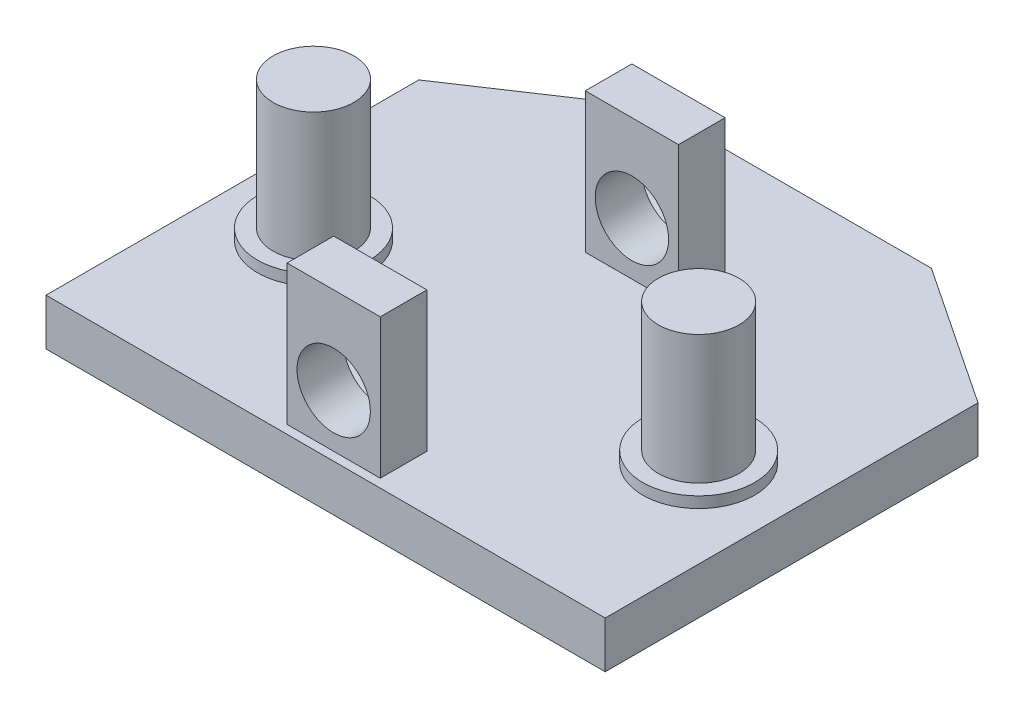
ISO-10303-21;
HEADER;
FILE_DESCRIPTION(('STEP AP214'),'2;1');
FILE_NAME('part.step','',(''),(''),'','','');
FILE_SCHEMA(('AUTOMOTIVE_DESIGN { 1 0 10303 214 1 1 1 1 }'));
ENDSEC;
DATA;
#1=APPLICATION_CONTEXT('core data for automotive mechanical design processes');
#2=APPLICATION_PROTOCOL_DEFINITION('international standard','automotive_design',2000,#1);
#3=PRODUCT_CONTEXT('',#1,'mechanical');
#4=PRODUCT('Part','Part','',(#3));
#5=PRODUCT_RELATED_PRODUCT_CATEGORY('part','',(#4));
#6=PRODUCT_DEFINITION_FORMATION('','',#4);
#7=PRODUCT_DEFINITION_CONTEXT('part definition',#1,'design');
#8=PRODUCT_DEFINITION('design','',#6,#7);
#9=PRODUCT_DEFINITION_SHAPE('','',#8);
#10=(LENGTH_UNIT() NAMED_UNIT(*) SI_UNIT(.MILLI.,.METRE.));
#11=(NAMED_UNIT(*) PLANE_ANGLE_UNIT() SI_UNIT($,.RADIAN.));
#12=(NAMED_UNIT(*) SI_UNIT($,.STERADIAN.) SOLID_ANGLE_UNIT());
#13=UNCERTAINTY_MEASURE_WITH_UNIT(LENGTH_MEASURE(1.E-05),#10,'distance_accuracy_value','');
#14=(GEOMETRIC_REPRESENTATION_CONTEXT(3) GLOBAL_UNCERTAINTY_ASSIGNED_CONTEXT((#13)) GLOBAL_UNIT_ASSIGNED_CONTEXT((#10,
#11,#12)) REPRESENTATION_CONTEXT('',''));
#15=CARTESIAN_POINT('',(0.,0.,0.));
#16=DIRECTION('',(0.,0.,1.));
#17=DIRECTION('',(1.,0.,0.));
#18=AXIS2_PLACEMENT_3D('',#15,#16,#17);
#19=CARTESIAN_POINT('',(0.,6.35,0.));
#20=DIRECTION('',(0.,-1.,0.));
#21=DIRECTION('',(0.,0.,-1.));
#22=AXIS2_PLACEMENT_3D('',#19,#20,#21);
#23=PLANE('',#22);
#24=CARTESIAN_POINT('',(26.1732375243136,6.35,-24.6662117629538));
#25=DIRECTION('',(0.,-1.,0.));
#26=DIRECTION('',(0.,0.,-1.));
#27=AXIS2_PLACEMENT_3D('',#24,#25,#26);
#28=CIRCLE('',#27,7.62);
#29=CARTESIAN_POINT('',(26.1732375243136,6.35,-32.2862117629538));
#30=VERTEX_POINT('',#29);
#31=EDGE_CURVE('E11',#30,#30,#28,.F.);
#32=ORIENTED_EDGE('',*,*,#31,.F.);
#33=EDGE_LOOP('',(#32));
#34=FACE_BOUND('',#33,.T.);
#35=CARTESIAN_POINT('',(-26.3178350396864,6.35,-24.6662117629538));
#36=DIRECTION('',(0.,-1.,0.));
#37=DIRECTION('',(0.,0.,-1.));
#38=AXIS2_PLACEMENT_3D('',#35,#36,#37);
#39=CIRCLE('',#38,7.62);
#40=CARTESIAN_POINT('',(-26.3178350396864,6.35,-32.2862117629538));
#41=VERTEX_POINT('',#40);
#42=EDGE_CURVE('E234',#41,#41,#39,.F.);
#43=ORIENTED_EDGE('',*,*,#42,.F.);
#44=EDGE_LOOP('',(#43));
#45=FACE_BOUND('',#44,.T.);
#46=DIRECTION('',(0.,0.,-1.));
#47=VECTOR('',#46,1.);
#48=CARTESIAN_POINT('',(6.27770124231356,6.35,-1.1712117629538));
#49=LINE('',#48,#47);
#50=CARTESIAN_POINT('',(6.27770124231356,6.35,-1.1712117629538));
#51=VERTEX_POINT('',#50);
#52=CARTESIAN_POINT('',(6.27770124231356,6.35,-7.5212117629538));
#53=VERTEX_POINT('',#52);
#54=EDGE_CURVE('E165',#51,#53,#49,.T.);
#55=ORIENTED_EDGE('',*,*,#54,.F.);
#56=DIRECTION('',(1.,0.,0.));
#57=VECTOR('',#56,1.);
#58=CARTESIAN_POINT('',(-6.42229875768644,6.35,-1.1712117629538));
#59=LINE('',#58,#57);
#60=CARTESIAN_POINT('',(-6.42229875768644,6.35,-1.1712117629538));
#61=VERTEX_POINT('',#60);
#62=EDGE_CURVE('E170',#61,#51,#59,.T.);
#63=ORIENTED_EDGE('',*,*,#62,.F.);
#64=DIRECTION('',(0.,0.,1.));
#65=VECTOR('',#64,1.);
#66=CARTESIAN_POINT('',(-6.42229875768644,6.35,-1.1712117629538));
#67=LINE('',#66,#65);
#68=CARTESIAN_POINT('',(-6.42229875768644,6.35,-7.5212117629538));
#69=VERTEX_POINT('',#68);
#70=EDGE_CURVE('E182',#69,#61,#67,.T.);
#71=ORIENTED_EDGE('',*,*,#70,.F.);
#72=DIRECTION('',(-1.,0.,0.));
#73=VECTOR('',#72,1.);
#74=CARTESIAN_POINT('',(-6.42229875768644,6.35,-7.5212117629538));
#75=LINE('',#74,#73);
#76=EDGE_CURVE('E179',#53,#69,#75,.T.);
#77=ORIENTED_EDGE('',*,*,#76,.F.);
#78=EDGE_LOOP('',(#55,#63,#71,#77));
#79=FACE_BOUND('',#78,.T.);
#80=DIRECTION('',(0.,0.,-1.));
#81=VECTOR('',#80,1.);
#82=CARTESIAN_POINT('',(-38.1,6.35,0.));
#83=LINE('',#82,#81);
#84=CARTESIAN_POINT('',(-38.1,6.35,0.));
#85=VERTEX_POINT('',#84);
#86=CARTESIAN_POINT('',(-38.1,6.35,-50.8));
#87=VERTEX_POINT('',#86);
#88=EDGE_CURVE('E199',#85,#87,#83,.T.);
#89=ORIENTED_EDGE('',*,*,#88,.F.);
#90=DIRECTION('',(1.,0.,0.));
#91=VECTOR('',#90,1.);
#92=CARTESIAN_POINT('',(-38.1,6.35,0.));
#93=LINE('',#92,#91);
#94=CARTESIAN_POINT('',(38.1,6.35,0.));
#95=VERTEX_POINT('',#94);
#96=EDGE_CURVE('E214',#85,#95,#93,.T.);
#97=ORIENTED_EDGE('',*,*,#96,.T.);
#98=DIRECTION('',(0.,0.,-1.));
#99=VECTOR('',#98,1.);
#100=CARTESIAN_POINT('',(38.1,6.35,0.));
#101=LINE('',#100,#99);
#102=CARTESIAN_POINT('',(38.1,6.35,-50.8));
#103=VERTEX_POINT('',#102);
#104=EDGE_CURVE('E212',#95,#103,#101,.T.);
#105=ORIENTED_EDGE('',*,*,#104,.T.);
#106=DIRECTION('',(0.832050294337843,0.,0.554700196225229));
#107=VECTOR('',#106,1.);
#108=CARTESIAN_POINT('',(19.05,6.35,-63.5));
#109=LINE('',#108,#107);
#110=CARTESIAN_POINT('',(19.05,6.35,-63.5));
#111=VERTEX_POINT('',#110);
#112=EDGE_CURVE('E209',#111,#103,#109,.T.);
#113=ORIENTED_EDGE('',*,*,#112,.F.);
#114=DIRECTION('',(1.,0.,0.));
#115=VECTOR('',#114,1.);
#116=CARTESIAN_POINT('',(-19.05,6.35,-63.5));
#117=LINE('',#116,#115);
#118=CARTESIAN_POINT('',(-19.05,6.35,-63.5));
#119=VERTEX_POINT('',#118);
#120=EDGE_CURVE('E206',#119,#111,#117,.T.);
#121=ORIENTED_EDGE('',*,*,#120,.F.);
#122=DIRECTION('',(0.832050294337844,0.,-0.554700196225229));
#123=VECTOR('',#122,1.);
#124=CARTESIAN_POINT('',(-38.1,6.35,-50.8));
#125=LINE('',#124,#123);
#126=EDGE_CURVE('E202',#87,#119,#125,.T.);
#127=ORIENTED_EDGE('',*,*,#126,.F.);
#128=EDGE_LOOP('',(#89,#97,#105,#113,#121,#127));
#129=FACE_BOUND('',#128,.T.);
#130=DIRECTION('',(0.,0.,-1.));
#131=VECTOR('',#130,1.);
#132=CARTESIAN_POINT('',(6.27770124231356,6.35,-41.8112117629538));
#133=LINE('',#132,#131);
#134=CARTESIAN_POINT('',(6.27770124231356,6.35,-41.8112117629538));
#135=VERTEX_POINT('',#134);
#136=CARTESIAN_POINT('',(6.27770124231356,6.35,-48.1612117629538));
#137=VERTEX_POINT('',#136);
#138=EDGE_CURVE('E153',#135,#137,#133,.T.);
#139=ORIENTED_EDGE('',*,*,#138,.F.);
#140=DIRECTION('',(1.,0.,0.));
#141=VECTOR('',#140,1.);
#142=CARTESIAN_POINT('',(-6.42229875768644,6.35,-41.8112117629538));
#143=LINE('',#142,#141);
#144=CARTESIAN_POINT('',(-6.42229875768644,6.35,-41.8112117629538));
#145=VERTEX_POINT('',#144);
#146=EDGE_CURVE('E150',#145,#135,#143,.T.);
#147=ORIENTED_EDGE('',*,*,#146,.F.);
#148=DIRECTION('',(0.,0.,1.));
#149=VECTOR('',#148,1.);
#150=CARTESIAN_POINT('',(-6.42229875768644,6.35,-41.8112117629538));
#151=LINE('',#150,#149);
#152=CARTESIAN_POINT('',(-6.42229875768644,6.35,-48.1612117629538));
#153=VERTEX_POINT('',#152);
#154=EDGE_CURVE('E52',#153,#145,#151,.T.);
#155=ORIENTED_EDGE('',*,*,#154,.F.);
#156=DIRECTION('',(-1.,0.,0.));
#157=VECTOR('',#156,1.);
#158=CARTESIAN_POINT('',(-6.42229875768644,6.35,-48.1612117629538));
#159=LINE('',#158,#157);
#160=EDGE_CURVE('E47',#137,#153,#159,.T.);
#161=ORIENTED_EDGE('',*,*,#160,.F.);
#162=EDGE_LOOP('',(#139,#147,#155,#161));
#163=FACE_BOUND('',#162,.T.);
#164=ADVANCED_FACE('F32',(#34,#45,#79,#129,#163),#23,.F.);
#165=CARTESIAN_POINT('',(-38.1,6.35,0.));
#166=DIRECTION('',(-1.,0.,0.));
#167=DIRECTION('',(0.,0.,1.));
#168=AXIS2_PLACEMENT_3D('',#165,#166,#167);
#169=PLANE('',#168);
#170=DIRECTION('',(0.,0.,-1.));
#171=VECTOR('',#170,1.);
#172=CARTESIAN_POINT('',(-38.1,0.,0.));
#173=LINE('',#172,#171);
#174=CARTESIAN_POINT('',(-38.1,0.,0.));
#175=VERTEX_POINT('',#174);
#176=CARTESIAN_POINT('',(-38.1,0.,-50.8));
#177=VERTEX_POINT('',#176);
#178=EDGE_CURVE('E198',#175,#177,#173,.T.);
#179=ORIENTED_EDGE('',*,*,#178,.F.);
#180=DIRECTION('',(0.,-1.,0.));
#181=VECTOR('',#180,1.);
#182=CARTESIAN_POINT('',(-38.1,6.35,0.));
#183=LINE('',#182,#181);
#184=EDGE_CURVE('E232',#85,#175,#183,.T.);
#185=ORIENTED_EDGE('',*,*,#184,.F.);
#186=ORIENTED_EDGE('',*,*,#88,.T.);
#187=DIRECTION('',(0.,-1.,0.));
#188=VECTOR('',#187,1.);
#189=CARTESIAN_POINT('',(-38.1,6.35,-50.8));
#190=LINE('',#189,#188);
#191=EDGE_CURVE('E216',#87,#177,#190,.T.);
#192=ORIENTED_EDGE('',*,*,#191,.T.);
#193=EDGE_LOOP('',(#179,#185,#186,#192));
#194=FACE_BOUND('',#193,.T.);
#195=ADVANCED_FACE('F34',(#194),#169,.T.);
#196=CARTESIAN_POINT('',(-38.1,6.35,0.));
#197=DIRECTION('',(0.,0.,-1.));
#198=DIRECTION('',(-1.,0.,0.));
#199=AXIS2_PLACEMENT_3D('',#196,#197,#198);
#200=PLANE('',#199);
#201=DIRECTION('',(1.,0.,0.));
#202=VECTOR('',#201,1.);
#203=CARTESIAN_POINT('',(-38.1,0.,0.));
#204=LINE('',#203,#202);
#205=CARTESIAN_POINT('',(38.1,0.,0.));
#206=VERTEX_POINT('',#205);
#207=EDGE_CURVE('E203',#175,#206,#204,.T.);
#208=ORIENTED_EDGE('',*,*,#207,.T.);
#209=DIRECTION('',(0.,-1.,0.));
#210=VECTOR('',#209,1.);
#211=CARTESIAN_POINT('',(38.1,6.35,0.));
#212=LINE('',#211,#210);
#213=EDGE_CURVE('E235',#95,#206,#212,.T.);
#214=ORIENTED_EDGE('',*,*,#213,.F.);
#215=ORIENTED_EDGE('',*,*,#96,.F.);
#216=ORIENTED_EDGE('',*,*,#184,.T.);
#217=EDGE_LOOP('',(#208,#214,#215,#216));
#218=FACE_BOUND('',#217,.T.);
#219=ADVANCED_FACE('F278',(#218),#200,.F.);
#220=CARTESIAN_POINT('',(38.1,6.35,0.));
#221=DIRECTION('',(-1.,0.,0.));
#222=DIRECTION('',(0.,0.,1.));
#223=AXIS2_PLACEMENT_3D('',#220,#221,#222);
#224=PLANE('',#223);
#225=DIRECTION('',(0.,0.,-1.));
#226=VECTOR('',#225,1.);
#227=CARTESIAN_POINT('',(38.1,0.,0.));
#228=LINE('',#227,#226);
#229=CARTESIAN_POINT('',(38.1,0.,-50.8));
#230=VERTEX_POINT('',#229);
#231=EDGE_CURVE('E228',#206,#230,#228,.T.);
#232=ORIENTED_EDGE('',*,*,#231,.T.);
#233=DIRECTION('',(0.,-1.,0.));
#234=VECTOR('',#233,1.);
#235=CARTESIAN_POINT('',(38.1,6.35,-50.8));
#236=LINE('',#235,#234);
#237=EDGE_CURVE('E238',#103,#230,#236,.T.);
#238=ORIENTED_EDGE('',*,*,#237,.F.);
#239=ORIENTED_EDGE('',*,*,#104,.F.);
#240=ORIENTED_EDGE('',*,*,#213,.T.);
#241=EDGE_LOOP('',(#232,#238,#239,#240));
#242=FACE_BOUND('',#241,.T.);
#243=ADVANCED_FACE('F293',(#242),#224,.F.);
#244=CARTESIAN_POINT('',(19.05,6.35,-63.5));
#245=DIRECTION('',(0.554700196225229,0.,-0.832050294337843));
#246=DIRECTION('',(-0.832050294337843,0.,-0.554700196225229));
#247=AXIS2_PLACEMENT_3D('',#244,#245,#246);
#248=PLANE('',#247);
#249=DIRECTION('',(0.832050294337843,0.,0.554700196225229));
#250=VECTOR('',#249,1.);
#251=CARTESIAN_POINT('',(19.05,0.,-63.5));
#252=LINE('',#251,#250);
#253=CARTESIAN_POINT('',(19.05,0.,-63.5));
#254=VERTEX_POINT('',#253);
#255=EDGE_CURVE('E225',#254,#230,#252,.T.);
#256=ORIENTED_EDGE('',*,*,#255,.F.);
#257=DIRECTION('',(0.,-1.,0.));
#258=VECTOR('',#257,1.);
#259=CARTESIAN_POINT('',(19.05,6.35,-63.5));
#260=LINE('',#259,#258);
#261=EDGE_CURVE('E240',#111,#254,#260,.T.);
#262=ORIENTED_EDGE('',*,*,#261,.F.);
#263=ORIENTED_EDGE('',*,*,#112,.T.);
#264=ORIENTED_EDGE('',*,*,#237,.T.);
#265=EDGE_LOOP('',(#256,#262,#263,#264));
#266=FACE_BOUND('',#265,.T.);
#267=ADVANCED_FACE('F297',(#266),#248,.T.);
#268=CARTESIAN_POINT('',(-19.05,6.35,-63.5));
#269=DIRECTION('',(0.,0.,-1.));
#270=DIRECTION('',(-1.,0.,0.));
#271=AXIS2_PLACEMENT_3D('',#268,#269,#270);
#272=PLANE('',#271);
#273=DIRECTION('',(1.,0.,0.));
#274=VECTOR('',#273,1.);
#275=CARTESIAN_POINT('',(-19.05,0.,-63.5));
#276=LINE('',#275,#274);
#277=CARTESIAN_POINT('',(-19.05,0.,-63.5));
#278=VERTEX_POINT('',#277);
#279=EDGE_CURVE('E222',#278,#254,#276,.T.);
#280=ORIENTED_EDGE('',*,*,#279,.F.);
#281=DIRECTION('',(0.,-1.,0.));
#282=VECTOR('',#281,1.);
#283=CARTESIAN_POINT('',(-19.05,6.35,-63.5));
#284=LINE('',#283,#282);
#285=EDGE_CURVE('E242',#119,#278,#284,.T.);
#286=ORIENTED_EDGE('',*,*,#285,.F.);
#287=ORIENTED_EDGE('',*,*,#120,.T.);
#288=ORIENTED_EDGE('',*,*,#261,.T.);
#289=EDGE_LOOP('',(#280,#286,#287,#288));
#290=FACE_BOUND('',#289,.T.);
#291=ADVANCED_FACE('F301',(#290),#272,.T.);
#292=CARTESIAN_POINT('',(-38.1,6.35,-50.8));
#293=DIRECTION('',(-0.554700196225229,0.,-0.832050294337844));
#294=DIRECTION('',(-0.832050294337844,0.,0.554700196225229));
#295=AXIS2_PLACEMENT_3D('',#292,#293,#294);
#296=PLANE('',#295);
#297=DIRECTION('',(0.832050294337844,0.,-0.554700196225229));
#298=VECTOR('',#297,1.);
#299=CARTESIAN_POINT('',(-38.1,0.,-50.8));
#300=LINE('',#299,#298);
#301=EDGE_CURVE('E219',#177,#278,#300,.T.);
#302=ORIENTED_EDGE('',*,*,#301,.F.);
#303=ORIENTED_EDGE('',*,*,#191,.F.);
#304=ORIENTED_EDGE('',*,*,#126,.T.);
#305=ORIENTED_EDGE('',*,*,#285,.T.);
#306=EDGE_LOOP('',(#302,#303,#304,#305));
#307=FACE_BOUND('',#306,.T.);
#308=ADVANCED_FACE('F289',(#307),#296,.T.);
#309=CARTESIAN_POINT('',(0.,0.,0.));
#310=DIRECTION('',(0.,-1.,0.));
#311=DIRECTION('',(0.,0.,-1.));
#312=AXIS2_PLACEMENT_3D('',#309,#310,#311);
#313=PLANE('',#312);
#314=ORIENTED_EDGE('',*,*,#178,.T.);
#315=ORIENTED_EDGE('',*,*,#301,.T.);
#316=ORIENTED_EDGE('',*,*,#279,.T.);
#317=ORIENTED_EDGE('',*,*,#255,.T.);
#318=ORIENTED_EDGE('',*,*,#231,.F.);
#319=ORIENTED_EDGE('',*,*,#207,.F.);
#320=EDGE_LOOP('',(#314,#315,#316,#317,#318,#319));
#321=FACE_BOUND('',#320,.T.);
#322=ADVANCED_FACE('F286',(#321),#313,.T.);
#323=CARTESIAN_POINT('',(6.27770124231356,25.4,-1.1712117629538));
#324=DIRECTION('',(-1.,0.,0.));
#325=DIRECTION('',(0.,0.,1.));
#326=AXIS2_PLACEMENT_3D('',#323,#324,#325);
#327=PLANE('',#326);
#328=ORIENTED_EDGE('',*,*,#54,.T.);
#329=DIRECTION('',(0.,-1.,0.));
#330=VECTOR('',#329,1.);
#331=CARTESIAN_POINT('',(6.27770124231356,25.4,-7.5212117629538));
#332=LINE('',#331,#330);
#333=CARTESIAN_POINT('',(6.27770124231356,25.4,-7.5212117629538));
#334=VERTEX_POINT('',#333);
#335=EDGE_CURVE('E195',#334,#53,#332,.T.);
#336=ORIENTED_EDGE('',*,*,#335,.F.);
#337=DIRECTION('',(0.,0.,-1.));
#338=VECTOR('',#337,1.);
#339=CARTESIAN_POINT('',(6.27770124231356,25.4,-1.1712117629538));
#340=LINE('',#339,#338);
#341=CARTESIAN_POINT('',(6.27770124231356,25.4,-1.1712117629538));
#342=VERTEX_POINT('',#341);
#343=EDGE_CURVE('E166',#342,#334,#340,.T.);
#344=ORIENTED_EDGE('',*,*,#343,.F.);
#345=DIRECTION('',(0.,-1.,0.));
#346=VECTOR('',#345,1.);
#347=CARTESIAN_POINT('',(6.27770124231356,25.4,-1.1712117629538));
#348=LINE('',#347,#346);
#349=EDGE_CURVE('E176',#342,#51,#348,.T.);
#350=ORIENTED_EDGE('',*,*,#349,.T.);
#351=EDGE_LOOP('',(#328,#336,#344,#350));
#352=FACE_BOUND('',#351,.T.);
#353=ADVANCED_FACE('F284',(#352),#327,.F.);
#354=CARTESIAN_POINT('',(-6.42229875768644,25.4,-7.5212117629538));
#355=DIRECTION('',(0.,0.,1.));
#356=DIRECTION('',(1.,0.,0.));
#357=AXIS2_PLACEMENT_3D('',#354,#355,#356);
#358=PLANE('',#357);
#359=CARTESIAN_POINT('',(-0.0722987576864415,13.5246697625888,-7.5212117629538));
#360=DIRECTION('',(0.,0.,1.));
#361=DIRECTION('',(1.,0.,0.));
#362=AXIS2_PLACEMENT_3D('',#359,#360,#361);
#363=CIRCLE('',#362,5.);
#364=CARTESIAN_POINT('',(4.92770124231356,13.5246697625888,-7.5212117629538));
#365=VERTEX_POINT('',#364);
#366=EDGE_CURVE('E157',#365,#365,#363,.T.);
#367=ORIENTED_EDGE('',*,*,#366,.T.);
#368=EDGE_LOOP('',(#367));
#369=FACE_BOUND('',#368,.T.);
#370=ORIENTED_EDGE('',*,*,#76,.T.);
#371=DIRECTION('',(0.,-1.,0.));
#372=VECTOR('',#371,1.);
#373=CARTESIAN_POINT('',(-6.42229875768644,25.4,-7.5212117629538));
#374=LINE('',#373,#372);
#375=CARTESIAN_POINT('',(-6.42229875768644,25.4,-7.5212117629538));
#376=VERTEX_POINT('',#375);
#377=EDGE_CURVE('E192',#376,#69,#374,.T.);
#378=ORIENTED_EDGE('',*,*,#377,.F.);
#379=DIRECTION('',(-1.,0.,0.));
#380=VECTOR('',#379,1.);
#381=CARTESIAN_POINT('',(-6.42229875768644,25.4,-7.5212117629538));
#382=LINE('',#381,#380);
#383=EDGE_CURVE('E169',#334,#376,#382,.T.);
#384=ORIENTED_EDGE('',*,*,#383,.F.);
#385=ORIENTED_EDGE('',*,*,#335,.T.);
#386=EDGE_LOOP('',(#370,#378,#384,#385));
#387=FACE_BOUND('',#386,.T.);
#388=ADVANCED_FACE('F401',(#369,#387),#358,.F.);
#389=CARTESIAN_POINT('',(-6.42229875768644,25.4,-1.1712117629538));
#390=DIRECTION('',(1.,0.,0.));
#391=DIRECTION('',(0.,0.,-1.));
#392=AXIS2_PLACEMENT_3D('',#389,#390,#391);
#393=PLANE('',#392);
#394=ORIENTED_EDGE('',*,*,#70,.T.);
#395=DIRECTION('',(0.,-1.,0.));
#396=VECTOR('',#395,1.);
#397=CARTESIAN_POINT('',(-6.42229875768644,25.4,-1.1712117629538));
#398=LINE('',#397,#396);
#399=CARTESIAN_POINT('',(-6.42229875768644,25.4,-1.1712117629538));
#400=VERTEX_POINT('',#399);
#401=EDGE_CURVE('E189',#400,#61,#398,.T.);
#402=ORIENTED_EDGE('',*,*,#401,.F.);
#403=DIRECTION('',(0.,0.,1.));
#404=VECTOR('',#403,1.);
#405=CARTESIAN_POINT('',(-6.42229875768644,25.4,-1.1712117629538));
#406=LINE('',#405,#404);
#407=EDGE_CURVE('E172',#376,#400,#406,.T.);
#408=ORIENTED_EDGE('',*,*,#407,.F.);
#409=ORIENTED_EDGE('',*,*,#377,.T.);
#410=EDGE_LOOP('',(#394,#402,#408,#409));
#411=FACE_BOUND('',#410,.T.);
#412=ADVANCED_FACE('F399',(#411),#393,.F.);
#413=CARTESIAN_POINT('',(-6.42229875768644,25.4,-1.1712117629538));
#414=DIRECTION('',(0.,0.,-1.));
#415=DIRECTION('',(-1.,0.,0.));
#416=AXIS2_PLACEMENT_3D('',#413,#414,#415);
#417=PLANE('',#416);
#418=CARTESIAN_POINT('',(-0.0722987576864415,13.5246697625888,-1.1712117629538));
#419=DIRECTION('',(0.,0.,1.));
#420=DIRECTION('',(1.,0.,0.));
#421=AXIS2_PLACEMENT_3D('',#418,#419,#420);
#422=CIRCLE('',#421,5.);
#423=CARTESIAN_POINT('',(4.92770124231356,13.5246697625888,-1.1712117629538));
#424=VERTEX_POINT('',#423);
#425=EDGE_CURVE('E154',#424,#424,#422,.T.);
#426=ORIENTED_EDGE('',*,*,#425,.F.);
#427=EDGE_LOOP('',(#426));
#428=FACE_BOUND('',#427,.T.);
#429=ORIENTED_EDGE('',*,*,#62,.T.);
#430=ORIENTED_EDGE('',*,*,#349,.F.);
#431=DIRECTION('',(1.,0.,0.));
#432=VECTOR('',#431,1.);
#433=CARTESIAN_POINT('',(-6.42229875768644,25.4,-1.1712117629538));
#434=LINE('',#433,#432);
#435=EDGE_CURVE('E174',#400,#342,#434,.T.);
#436=ORIENTED_EDGE('',*,*,#435,.F.);
#437=ORIENTED_EDGE('',*,*,#401,.T.);
#438=EDGE_LOOP('',(#429,#430,#436,#437));
#439=FACE_BOUND('',#438,.T.);
#440=ADVANCED_FACE('F390',(#428,#439),#417,.F.);
#441=CARTESIAN_POINT('',(0.,25.4,0.));
#442=DIRECTION('',(0.,-1.,0.));
#443=DIRECTION('',(0.,0.,-1.));
#444=AXIS2_PLACEMENT_3D('',#441,#442,#443);
#445=PLANE('',#444);
#446=ORIENTED_EDGE('',*,*,#343,.T.);
#447=ORIENTED_EDGE('',*,*,#383,.T.);
#448=ORIENTED_EDGE('',*,*,#407,.T.);
#449=ORIENTED_EDGE('',*,*,#435,.T.);
#450=EDGE_LOOP('',(#446,#447,#448,#449));
#451=FACE_BOUND('',#450,.T.);
#452=ADVANCED_FACE('F395',(#451),#445,.F.);
#453=CARTESIAN_POINT('',(-0.0722987576864415,13.5246697625888,-13.8712117629538));
#454=DIRECTION('',(0.,0.,1.));
#455=DIRECTION('',(1.,0.,0.));
#456=AXIS2_PLACEMENT_3D('',#453,#454,#455);
#457=CYLINDRICAL_SURFACE('',#456,5.);
#458=ORIENTED_EDGE('',*,*,#425,.T.);
#459=EDGE_LOOP('',(#458));
#460=FACE_BOUND('',#459,.T.);
#461=ORIENTED_EDGE('',*,*,#366,.F.);
#462=EDGE_LOOP('',(#461));
#463=FACE_BOUND('',#462,.T.);
#464=ADVANCED_FACE('F415',(#460,#463),#457,.F.);
#465=CARTESIAN_POINT('',(6.27770124231356,25.4,-41.8112117629538));
#466=DIRECTION('',(-1.,0.,0.));
#467=DIRECTION('',(0.,0.,1.));
#468=AXIS2_PLACEMENT_3D('',#465,#466,#467);
#469=PLANE('',#468);
#470=ORIENTED_EDGE('',*,*,#138,.T.);
#471=DIRECTION('',(0.,-1.,0.));
#472=VECTOR('',#471,1.);
#473=CARTESIAN_POINT('',(6.27770124231356,25.4,-48.1612117629538));
#474=LINE('',#473,#472);
#475=CARTESIAN_POINT('',(6.27770124231356,25.4,-48.1612117629538));
#476=VERTEX_POINT('',#475);
#477=EDGE_CURVE('E134',#476,#137,#474,.T.);
#478=ORIENTED_EDGE('',*,*,#477,.F.);
#479=DIRECTION('',(0.,0.,-1.));
#480=VECTOR('',#479,1.);
#481=CARTESIAN_POINT('',(6.27770124231356,25.4,-41.8112117629538));
#482=LINE('',#481,#480);
#483=CARTESIAN_POINT('',(6.27770124231356,25.4,-41.8112117629538));
#484=VERTEX_POINT('',#483);
#485=EDGE_CURVE('E141',#484,#476,#482,.T.);
#486=ORIENTED_EDGE('',*,*,#485,.F.);
#487=DIRECTION('',(0.,-1.,0.));
#488=VECTOR('',#487,1.);
#489=CARTESIAN_POINT('',(6.27770124231356,25.4,-41.8112117629538));
#490=LINE('',#489,#488);
#491=EDGE_CURVE('E330',#484,#135,#490,.T.);
#492=ORIENTED_EDGE('',*,*,#491,.T.);
#493=EDGE_LOOP('',(#470,#478,#486,#492));
#494=FACE_BOUND('',#493,.T.);
#495=ADVANCED_FACE('F152',(#494),#469,.F.);
#496=CARTESIAN_POINT('',(-6.42229875768644,25.4,-48.1612117629538));
#497=DIRECTION('',(0.,0.,1.));
#498=DIRECTION('',(1.,0.,0.));
#499=AXIS2_PLACEMENT_3D('',#496,#497,#498);
#500=PLANE('',#499);
#501=CARTESIAN_POINT('',(-0.0722987576864415,13.5246697625888,-48.1612117629538));
#502=DIRECTION('',(0.,0.,1.));
#503=DIRECTION('',(1.,0.,0.));
#504=AXIS2_PLACEMENT_3D('',#501,#502,#503);
#505=CIRCLE('',#504,5.);
#506=CARTESIAN_POINT('',(4.92770124231356,13.5246697625888,-48.1612117629538));
#507=VERTEX_POINT('',#506);
#508=EDGE_CURVE('E325',#507,#507,#505,.T.);
#509=ORIENTED_EDGE('',*,*,#508,.T.);
#510=EDGE_LOOP('',(#509));
#511=FACE_BOUND('',#510,.T.);
#512=ORIENTED_EDGE('',*,*,#160,.T.);
#513=DIRECTION('',(0.,-1.,0.));
#514=VECTOR('',#513,1.);
#515=CARTESIAN_POINT('',(-6.42229875768644,25.4,-48.1612117629538));
#516=LINE('',#515,#514);
#517=CARTESIAN_POINT('',(-6.42229875768644,25.4,-48.1612117629538));
#518=VERTEX_POINT('',#517);
#519=EDGE_CURVE('E137',#518,#153,#516,.T.);
#520=ORIENTED_EDGE('',*,*,#519,.F.);
#521=DIRECTION('',(-1.,0.,0.));
#522=VECTOR('',#521,1.);
#523=CARTESIAN_POINT('',(-6.42229875768644,25.4,-48.1612117629538));
#524=LINE('',#523,#522);
#525=EDGE_CURVE('E130',#476,#518,#524,.T.);
#526=ORIENTED_EDGE('',*,*,#525,.F.);
#527=ORIENTED_EDGE('',*,*,#477,.T.);
#528=EDGE_LOOP('',(#512,#520,#526,#527));
#529=FACE_BOUND('',#528,.T.);
#530=ADVANCED_FACE('F132',(#511,#529),#500,.F.);
#531=CARTESIAN_POINT('',(-6.42229875768644,25.4,-41.8112117629538));
#532=DIRECTION('',(1.,0.,0.));
#533=DIRECTION('',(0.,0.,-1.));
#534=AXIS2_PLACEMENT_3D('',#531,#532,#533);
#535=PLANE('',#534);
#536=ORIENTED_EDGE('',*,*,#154,.T.);
#537=DIRECTION('',(0.,-1.,0.));
#538=VECTOR('',#537,1.);
#539=CARTESIAN_POINT('',(-6.42229875768644,25.4,-41.8112117629538));
#540=LINE('',#539,#538);
#541=CARTESIAN_POINT('',(-6.42229875768644,25.4,-41.8112117629538));
#542=VERTEX_POINT('',#541);
#543=EDGE_CURVE('E159',#542,#145,#540,.T.);
#544=ORIENTED_EDGE('',*,*,#543,.F.);
#545=DIRECTION('',(0.,0.,1.));
#546=VECTOR('',#545,1.);
#547=CARTESIAN_POINT('',(-6.42229875768644,25.4,-41.8112117629538));
#548=LINE('',#547,#546);
#549=EDGE_CURVE('E140',#518,#542,#548,.T.);
#550=ORIENTED_EDGE('',*,*,#549,.F.);
#551=ORIENTED_EDGE('',*,*,#519,.T.);
#552=EDGE_LOOP('',(#536,#544,#550,#551));
#553=FACE_BOUND('',#552,.T.);
#554=ADVANCED_FACE('F423',(#553),#535,.F.);
#555=CARTESIAN_POINT('',(-6.42229875768644,25.4,-41.8112117629538));
#556=DIRECTION('',(0.,0.,-1.));
#557=DIRECTION('',(-1.,0.,0.));
#558=AXIS2_PLACEMENT_3D('',#555,#556,#557);
#559=PLANE('',#558);
#560=CARTESIAN_POINT('',(-0.0722987576864415,13.5246697625888,-41.8112117629538));
#561=DIRECTION('',(0.,0.,1.));
#562=DIRECTION('',(1.,0.,0.));
#563=AXIS2_PLACEMENT_3D('',#560,#561,#562);
#564=CIRCLE('',#563,5.);
#565=CARTESIAN_POINT('',(4.92770124231356,13.5246697625888,-41.8112117629538));
#566=VERTEX_POINT('',#565);
#567=EDGE_CURVE('E341',#566,#566,#564,.T.);
#568=ORIENTED_EDGE('',*,*,#567,.F.);
#569=EDGE_LOOP('',(#568));
#570=FACE_BOUND('',#569,.T.);
#571=ORIENTED_EDGE('',*,*,#146,.T.);
#572=ORIENTED_EDGE('',*,*,#491,.F.);
#573=DIRECTION('',(1.,0.,0.));
#574=VECTOR('',#573,1.);
#575=CARTESIAN_POINT('',(-6.42229875768644,25.4,-41.8112117629538));
#576=LINE('',#575,#574);
#577=EDGE_CURVE('E146',#542,#484,#576,.T.);
#578=ORIENTED_EDGE('',*,*,#577,.F.);
#579=ORIENTED_EDGE('',*,*,#543,.T.);
#580=EDGE_LOOP('',(#571,#572,#578,#579));
#581=FACE_BOUND('',#580,.T.);
#582=ADVANCED_FACE('F329',(#570,#581),#559,.F.);
#583=CARTESIAN_POINT('',(0.,25.4,-40.64));
#584=DIRECTION('',(0.,-1.,0.));
#585=DIRECTION('',(0.,0.,-1.));
#586=AXIS2_PLACEMENT_3D('',#583,#584,#585);
#587=PLANE('',#586);
#588=ORIENTED_EDGE('',*,*,#485,.T.);
#589=ORIENTED_EDGE('',*,*,#525,.T.);
#590=ORIENTED_EDGE('',*,*,#549,.T.);
#591=ORIENTED_EDGE('',*,*,#577,.T.);
#592=EDGE_LOOP('',(#588,#589,#590,#591));
#593=FACE_BOUND('',#592,.T.);
#594=ADVANCED_FACE('F144',(#593),#587,.F.);
#595=CARTESIAN_POINT('',(-0.0722987576864415,13.5246697625888,-54.5112117629538));
#596=DIRECTION('',(0.,0.,1.));
#597=DIRECTION('',(1.,0.,0.));
#598=AXIS2_PLACEMENT_3D('',#595,#596,#597);
#599=CYLINDRICAL_SURFACE('',#598,5.);
#600=ORIENTED_EDGE('',*,*,#567,.T.);
#601=EDGE_LOOP('',(#600));
#602=FACE_BOUND('',#601,.T.);
#603=ORIENTED_EDGE('',*,*,#508,.F.);
#604=EDGE_LOOP('',(#603));
#605=FACE_BOUND('',#604,.T.);
#606=ADVANCED_FACE('F375',(#602,#605),#599,.F.);
#607=CARTESIAN_POINT('',(-26.3178350396864,7.85,-24.6662117629538));
#608=DIRECTION('',(0.,-1.,0.));
#609=DIRECTION('',(0.,0.,-1.));
#610=AXIS2_PLACEMENT_3D('',#607,#608,#609);
#611=CYLINDRICAL_SURFACE('',#610,7.62);
#612=CARTESIAN_POINT('',(-26.3178350396864,7.85,-24.6662117629538));
#613=DIRECTION('',(0.,1.,0.));
#614=DIRECTION('',(0.,0.,1.));
#615=AXIS2_PLACEMENT_3D('',#612,#613,#614);
#616=CIRCLE('',#615,7.62);
#617=CARTESIAN_POINT('',(-26.3178350396864,7.85,-17.0462117629538));
#618=VERTEX_POINT('',#617);
#619=EDGE_CURVE('E249',#618,#618,#616,.T.);
#620=ORIENTED_EDGE('',*,*,#619,.F.);
#621=EDGE_LOOP('',(#620));
#622=FACE_BOUND('',#621,.T.);
#623=ORIENTED_EDGE('',*,*,#42,.T.);
#624=EDGE_LOOP('',(#623));
#625=FACE_BOUND('',#624,.T.);
#626=ADVANCED_FACE('F372',(#622,#625),#611,.T.);
#627=CARTESIAN_POINT('',(-26.3178350396864,7.85,-24.6662117629538));
#628=DIRECTION('',(0.,1.,0.));
#629=DIRECTION('',(0.,0.,1.));
#630=AXIS2_PLACEMENT_3D('',#627,#628,#629);
#631=PLANE('',#630);
#632=CARTESIAN_POINT('',(-26.3178350684825,7.85,-24.6662117629538));
#633=DIRECTION('',(0.,1.,0.));
#634=DIRECTION('',(0.,0.,1.));
#635=AXIS2_PLACEMENT_3D('',#632,#633,#634);
#636=CIRCLE('',#635,5.5);
#637=CARTESIAN_POINT('',(-26.3178350684825,7.85,-19.1662117629538));
#638=VERTEX_POINT('',#637);
#639=EDGE_CURVE('E245',#638,#638,#636,.T.);
#640=ORIENTED_EDGE('',*,*,#639,.F.);
#641=EDGE_LOOP('',(#640));
#642=FACE_BOUND('',#641,.T.);
#643=ORIENTED_EDGE('',*,*,#619,.T.);
#644=EDGE_LOOP('',(#643));
#645=FACE_BOUND('',#644,.T.);
#646=ADVANCED_FACE('F370',(#642,#645),#631,.T.);
#647=CARTESIAN_POINT('',(-26.3178350684825,25.4,-24.6662117629538));
#648=DIRECTION('',(0.,1.,0.));
#649=DIRECTION('',(0.,0.,1.));
#650=AXIS2_PLACEMENT_3D('',#647,#648,#649);
#651=PLANE('',#650);
#652=CARTESIAN_POINT('',(-26.3178350684825,25.4,-24.6662117629538));
#653=DIRECTION('',(0.,1.,0.));
#654=DIRECTION('',(0.,0.,1.));
#655=AXIS2_PLACEMENT_3D('',#652,#653,#654);
#656=CIRCLE('',#655,5.5);
#657=CARTESIAN_POINT('',(-26.3178350684825,25.4,-19.1662117629538));
#658=VERTEX_POINT('',#657);
#659=EDGE_CURVE('E344',#658,#658,#656,.T.);
#660=ORIENTED_EDGE('',*,*,#659,.T.);
#661=EDGE_LOOP('',(#660));
#662=FACE_BOUND('',#661,.T.);
#663=ADVANCED_FACE('F366',(#662),#651,.T.);
#664=CARTESIAN_POINT('',(-26.3178350684825,25.4,-24.6662117629538));
#665=DIRECTION('',(0.,-1.,0.));
#666=DIRECTION('',(0.,0.,-1.));
#667=AXIS2_PLACEMENT_3D('',#664,#665,#666);
#668=CYLINDRICAL_SURFACE('',#667,5.5);
#669=ORIENTED_EDGE('',*,*,#639,.T.);
#670=EDGE_LOOP('',(#669));
#671=FACE_BOUND('',#670,.T.);
#672=ORIENTED_EDGE('',*,*,#659,.F.);
#673=EDGE_LOOP('',(#672));
#674=FACE_BOUND('',#673,.T.);
#675=ADVANCED_FACE('F358',(#671,#674),#668,.T.);
#676=CARTESIAN_POINT('',(26.1732375243136,7.85,-24.6662117629538));
#677=DIRECTION('',(0.,-1.,0.));
#678=DIRECTION('',(0.,0.,-1.));
#679=AXIS2_PLACEMENT_3D('',#676,#677,#678);
#680=CYLINDRICAL_SURFACE('',#679,7.62);
#681=CARTESIAN_POINT('',(26.1732375243136,7.85,-24.6662117629538));
#682=DIRECTION('',(0.,1.,0.));
#683=DIRECTION('',(0.,0.,-1.));
#684=AXIS2_PLACEMENT_3D('',#681,#682,#683);
#685=CIRCLE('',#684,7.62);
#686=CARTESIAN_POINT('',(26.1732375243136,7.85,-32.2862117629538));
#687=VERTEX_POINT('',#686);
#688=EDGE_CURVE('E351',#687,#687,#685,.T.);
#689=ORIENTED_EDGE('',*,*,#688,.F.);
#690=EDGE_LOOP('',(#689));
#691=FACE_BOUND('',#690,.T.);
#692=ORIENTED_EDGE('',*,*,#31,.T.);
#693=EDGE_LOOP('',(#692));
#694=FACE_BOUND('',#693,.T.);
#695=ADVANCED_FACE('F355',(#691,#694),#680,.T.);
#696=CARTESIAN_POINT('',(26.1732375243136,7.85,-24.6662117629538));
#697=DIRECTION('',(0.,-1.,0.));
#698=DIRECTION('',(0.,0.,-1.));
#699=AXIS2_PLACEMENT_3D('',#696,#697,#698);
#700=PLANE('',#699);
#701=CARTESIAN_POINT('',(26.1732375531096,7.85,-24.6662117629538));
#702=DIRECTION('',(0.,-1.,0.));
#703=DIRECTION('',(0.,0.,-1.));
#704=AXIS2_PLACEMENT_3D('',#701,#702,#703);
#705=CIRCLE('',#704,5.5);
#706=CARTESIAN_POINT('',(26.1732375531096,7.85,-30.1662117629538));
#707=VERTEX_POINT('',#706);
#708=EDGE_CURVE('E40',#707,#707,#705,.T.);
#709=ORIENTED_EDGE('',*,*,#708,.T.);
#710=EDGE_LOOP('',(#709));
#711=FACE_BOUND('',#710,.T.);
#712=ORIENTED_EDGE('',*,*,#688,.T.);
#713=EDGE_LOOP('',(#712));
#714=FACE_BOUND('',#713,.T.);
#715=ADVANCED_FACE('F254',(#711,#714),#700,.F.);
#716=CARTESIAN_POINT('',(26.1732375531096,25.4,-24.6662117629538));
#717=DIRECTION('',(0.,1.,0.));
#718=DIRECTION('',(0.,0.,1.));
#719=AXIS2_PLACEMENT_3D('',#716,#717,#718);
#720=PLANE('',#719);
#721=CARTESIAN_POINT('',(26.1732375531096,25.4,-24.6662117629538));
#722=DIRECTION('',(0.,1.,0.));
#723=DIRECTION('',(0.,0.,1.));
#724=AXIS2_PLACEMENT_3D('',#721,#722,#723);
#725=CIRCLE('',#724,5.5);
#726=CARTESIAN_POINT('',(26.1732375531096,25.4,-19.1662117629538));
#727=VERTEX_POINT('',#726);
#728=EDGE_CURVE('E248',#727,#727,#725,.T.);
#729=ORIENTED_EDGE('',*,*,#728,.T.);
#730=EDGE_LOOP('',(#729));
#731=FACE_BOUND('',#730,.T.);
#732=ADVANCED_FACE('F259',(#731),#720,.T.);
#733=CARTESIAN_POINT('',(26.1732375531096,25.4,-24.6662117629538));
#734=DIRECTION('',(0.,-1.,0.));
#735=DIRECTION('',(0.,0.,-1.));
#736=AXIS2_PLACEMENT_3D('',#733,#734,#735);
#737=CYLINDRICAL_SURFACE('',#736,5.5);
#738=ORIENTED_EDGE('',*,*,#728,.F.);
#739=EDGE_LOOP('',(#738));
#740=FACE_BOUND('',#739,.T.);
#741=ORIENTED_EDGE('',*,*,#708,.F.);
#742=EDGE_LOOP('',(#741));
#743=FACE_BOUND('',#742,.T.);
#744=ADVANCED_FACE('F257',(#740,#743),#737,.T.);
#745=CLOSED_SHELL('',(#164,#195,#219,#243,#267,#291,#308,#322,#353,#388,#412,#440,#452,#464,
#495,#530,#554,#582,#594,#606,#626,#646,#663,#675,#695,#715,#732,#744));
#746=MANIFOLD_SOLID_BREP('B2',#745);
#747=ADVANCED_BREP_SHAPE_REPRESENTATION('',(#18,#746),#14);
#748=SHAPE_DEFINITION_REPRESENTATION(#9,#747);
ENDSEC;
END-ISO-10303-21;
